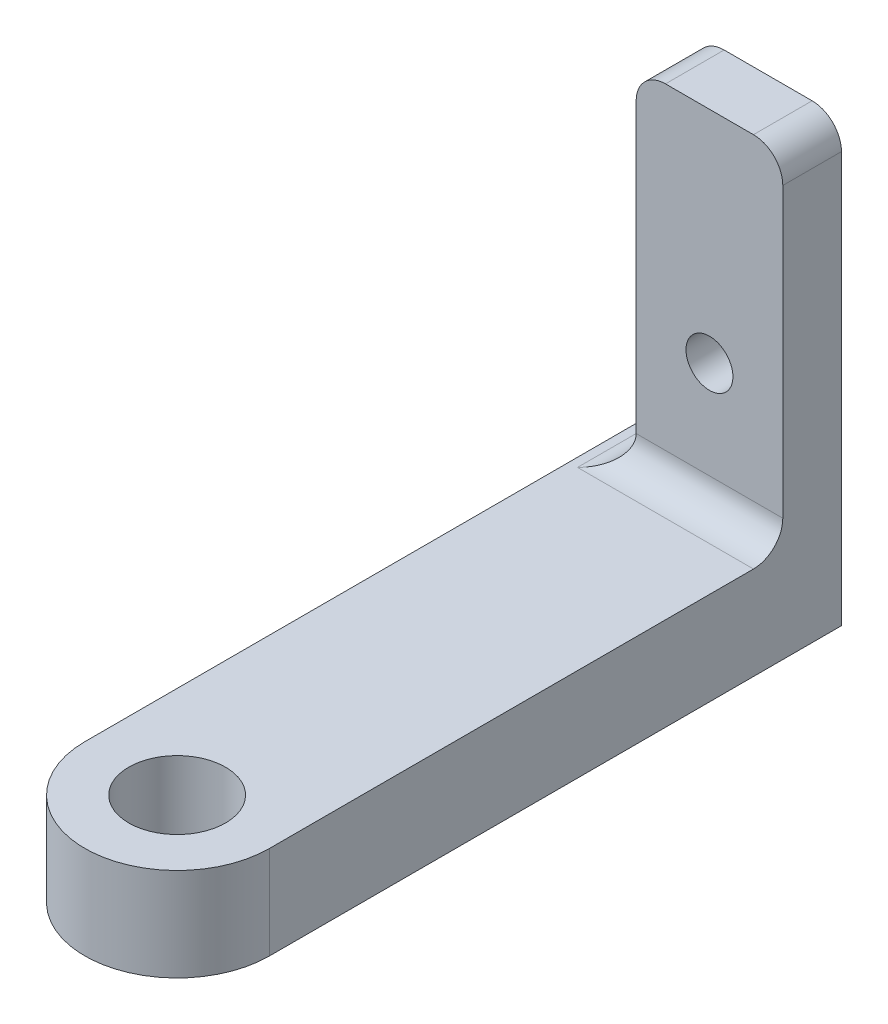
ISO-10303-21;
HEADER;
FILE_DESCRIPTION(('STEP AP214'),'2;1');
FILE_NAME('part.step','',(''),(''),'','','');
FILE_SCHEMA(('AUTOMOTIVE_DESIGN { 1 0 10303 214 1 1 1 1 }'));
ENDSEC;
DATA;
#1=APPLICATION_CONTEXT('core data for automotive mechanical design processes');
#2=APPLICATION_PROTOCOL_DEFINITION('international standard','automotive_design',2000,#1);
#3=PRODUCT_CONTEXT('',#1,'mechanical');
#4=PRODUCT('Part','Part','',(#3));
#5=PRODUCT_RELATED_PRODUCT_CATEGORY('part','',(#4));
#6=PRODUCT_DEFINITION_FORMATION('','',#4);
#7=PRODUCT_DEFINITION_CONTEXT('part definition',#1,'design');
#8=PRODUCT_DEFINITION('design','',#6,#7);
#9=PRODUCT_DEFINITION_SHAPE('','',#8);
#10=(LENGTH_UNIT() NAMED_UNIT(*) SI_UNIT(.MILLI.,.METRE.));
#11=(NAMED_UNIT(*) PLANE_ANGLE_UNIT() SI_UNIT($,.RADIAN.));
#12=(NAMED_UNIT(*) SI_UNIT($,.STERADIAN.) SOLID_ANGLE_UNIT());
#13=UNCERTAINTY_MEASURE_WITH_UNIT(LENGTH_MEASURE(1.E-05),#10,'distance_accuracy_value','');
#14=(GEOMETRIC_REPRESENTATION_CONTEXT(3) GLOBAL_UNCERTAINTY_ASSIGNED_CONTEXT((#13)) GLOBAL_UNIT_ASSIGNED_CONTEXT((#10,
#11,#12)) REPRESENTATION_CONTEXT('',''));
#15=CARTESIAN_POINT('',(0.,0.,0.));
#16=DIRECTION('',(0.,0.,1.));
#17=DIRECTION('',(1.,0.,0.));
#18=AXIS2_PLACEMENT_3D('',#15,#16,#17);
#19=CARTESIAN_POINT('',(0.,6.35,0.));
#20=DIRECTION('',(0.,-1.,0.));
#21=DIRECTION('',(0.,0.,-1.));
#22=AXIS2_PLACEMENT_3D('',#19,#20,#21);
#23=CYLINDRICAL_SURFACE('',#22,6.3);
#24=CARTESIAN_POINT('',(0.,0.,0.));
#25=DIRECTION('',(0.,1.,0.));
#26=DIRECTION('',(0.,0.,1.));
#27=AXIS2_PLACEMENT_3D('',#24,#25,#26);
#28=CIRCLE('',#27,6.3);
#29=CARTESIAN_POINT('',(-6.3,0.,0.));
#30=VERTEX_POINT('',#29);
#31=CARTESIAN_POINT('',(6.3,0.,0.));
#32=VERTEX_POINT('',#31);
#33=EDGE_CURVE('E153',#30,#32,#28,.T.);
#34=ORIENTED_EDGE('',*,*,#33,.T.);
#35=DIRECTION('',(0.,-1.,0.));
#36=VECTOR('',#35,1.);
#37=CARTESIAN_POINT('',(6.3,6.35,0.));
#38=LINE('',#37,#36);
#39=CARTESIAN_POINT('',(6.3,6.35,0.));
#40=VERTEX_POINT('',#39);
#41=EDGE_CURVE('E131',#40,#32,#38,.T.);
#42=ORIENTED_EDGE('',*,*,#41,.F.);
#43=CARTESIAN_POINT('',(0.,6.35,0.));
#44=DIRECTION('',(0.,1.,0.));
#45=DIRECTION('',(0.,0.,1.));
#46=AXIS2_PLACEMENT_3D('',#43,#44,#45);
#47=CIRCLE('',#46,6.3);
#48=CARTESIAN_POINT('',(-6.3,6.35,0.));
#49=VERTEX_POINT('',#48);
#50=EDGE_CURVE('E139',#49,#40,#47,.T.);
#51=ORIENTED_EDGE('',*,*,#50,.F.);
#52=DIRECTION('',(0.,-1.,0.));
#53=VECTOR('',#52,1.);
#54=CARTESIAN_POINT('',(-6.3,6.35,0.));
#55=LINE('',#54,#53);
#56=EDGE_CURVE('E253',#49,#30,#55,.T.);
#57=ORIENTED_EDGE('',*,*,#56,.T.);
#58=EDGE_LOOP('',(#34,#42,#51,#57));
#59=FACE_BOUND('',#58,.T.);
#60=ADVANCED_FACE('F45',(#59),#23,.T.);
#61=CARTESIAN_POINT('',(6.3,6.35,0.));
#62=DIRECTION('',(1.,0.,0.));
#63=DIRECTION('',(0.,0.,-1.));
#64=AXIS2_PLACEMENT_3D('',#61,#62,#63);
#65=PLANE('',#64);
#66=DIRECTION('',(0.,-1.,0.));
#67=VECTOR('',#66,1.);
#68=CARTESIAN_POINT('',(6.3,6.35,-39.));
#69=LINE('',#68,#67);
#70=CARTESIAN_POINT('',(6.3,28.,-39.));
#71=VERTEX_POINT('',#70);
#72=CARTESIAN_POINT('',(6.3,0.,-39.));
#73=VERTEX_POINT('',#72);
#74=EDGE_CURVE('E156',#71,#73,#69,.T.);
#75=ORIENTED_EDGE('',*,*,#74,.F.);
#76=DIRECTION('',(0.,0.,-1.));
#77=VECTOR('',#76,1.);
#78=CARTESIAN_POINT('',(6.3,28.,0.));
#79=LINE('',#78,#77);
#80=CARTESIAN_POINT('',(6.29999999999999,28.,-35.));
#81=VERTEX_POINT('',#80);
#82=EDGE_CURVE('E196',#71,#81,#79,.F.);
#83=ORIENTED_EDGE('',*,*,#82,.T.);
#84=DIRECTION('',(0.,-1.,0.));
#85=VECTOR('',#84,1.);
#86=CARTESIAN_POINT('',(6.29999999999999,0.,-35.));
#87=LINE('',#86,#85);
#88=CARTESIAN_POINT('',(6.29999999999999,8.35,-35.));
#89=VERTEX_POINT('',#88);
#90=EDGE_CURVE('E229',#81,#89,#87,.T.);
#91=ORIENTED_EDGE('',*,*,#90,.T.);
#92=CARTESIAN_POINT('',(6.3,8.35,-33.));
#93=DIRECTION('',(1.,0.,0.));
#94=DIRECTION('',(0.,0.,-1.));
#95=AXIS2_PLACEMENT_3D('',#92,#93,#94);
#96=CIRCLE('',#95,2.);
#97=CARTESIAN_POINT('',(6.3,6.35,-33.));
#98=VERTEX_POINT('',#97);
#99=EDGE_CURVE('E11',#89,#98,#96,.F.);
#100=ORIENTED_EDGE('',*,*,#99,.T.);
#101=DIRECTION('',(0.,0.,1.));
#102=VECTOR('',#101,1.);
#103=CARTESIAN_POINT('',(6.3,6.35,0.));
#104=LINE('',#103,#102);
#105=EDGE_CURVE('E126',#98,#40,#104,.T.);
#106=ORIENTED_EDGE('',*,*,#105,.T.);
#107=ORIENTED_EDGE('',*,*,#41,.T.);
#108=DIRECTION('',(0.,0.,1.));
#109=VECTOR('',#108,1.);
#110=CARTESIAN_POINT('',(6.3,0.,0.));
#111=LINE('',#110,#109);
#112=EDGE_CURVE('E257',#73,#32,#111,.T.);
#113=ORIENTED_EDGE('',*,*,#112,.F.);
#114=EDGE_LOOP('',(#75,#83,#91,#100,#106,#107,#113));
#115=FACE_BOUND('',#114,.T.);
#116=ADVANCED_FACE('F128',(#115),#65,.T.);
#117=CARTESIAN_POINT('',(0.,6.35,-39.));
#118=DIRECTION('',(0.,0.,-1.));
#119=DIRECTION('',(-1.,0.,0.));
#120=AXIS2_PLACEMENT_3D('',#117,#118,#119);
#121=PLANE('',#120);
#122=DIRECTION('',(1.,0.,0.));
#123=VECTOR('',#122,1.);
#124=CARTESIAN_POINT('',(6.29999999999999,30.,-39.));
#125=LINE('',#124,#123);
#126=CARTESIAN_POINT('',(-1.70000000000001,30.,-39.));
#127=VERTEX_POINT('',#126);
#128=CARTESIAN_POINT('',(4.3,30.,-39.));
#129=VERTEX_POINT('',#128);
#130=EDGE_CURVE('E216',#127,#129,#125,.T.);
#131=ORIENTED_EDGE('',*,*,#130,.T.);
#132=CARTESIAN_POINT('',(4.3,28.,-39.));
#133=DIRECTION('',(0.,0.,-1.));
#134=DIRECTION('',(-1.,0.,0.));
#135=AXIS2_PLACEMENT_3D('',#132,#133,#134);
#136=CIRCLE('',#135,2.);
#137=EDGE_CURVE('E62',#129,#71,#136,.T.);
#138=ORIENTED_EDGE('',*,*,#137,.T.);
#139=ORIENTED_EDGE('',*,*,#74,.T.);
#140=DIRECTION('',(1.,0.,0.));
#141=VECTOR('',#140,1.);
#142=CARTESIAN_POINT('',(0.,0.,-39.));
#143=LINE('',#142,#141);
#144=CARTESIAN_POINT('',(-6.3,0.,-39.));
#145=VERTEX_POINT('',#144);
#146=EDGE_CURVE('E260',#145,#73,#143,.T.);
#147=ORIENTED_EDGE('',*,*,#146,.F.);
#148=DIRECTION('',(0.,-1.,0.));
#149=VECTOR('',#148,1.);
#150=CARTESIAN_POINT('',(-6.3,6.35,-39.));
#151=LINE('',#150,#149);
#152=CARTESIAN_POINT('',(-6.3,6.35,-39.));
#153=VERTEX_POINT('',#152);
#154=EDGE_CURVE('E163',#153,#145,#151,.T.);
#155=ORIENTED_EDGE('',*,*,#154,.F.);
#156=DIRECTION('',(1.,0.,0.));
#157=VECTOR('',#156,1.);
#158=CARTESIAN_POINT('',(0.,6.35,-39.));
#159=LINE('',#158,#157);
#160=CARTESIAN_POINT('',(-5.70000000000001,6.35,-39.));
#161=VERTEX_POINT('',#160);
#162=EDGE_CURVE('E138',#153,#161,#159,.T.);
#163=ORIENTED_EDGE('',*,*,#162,.T.);
#164=CARTESIAN_POINT('',(-5.70000000000001,8.35,-39.));
#165=DIRECTION('',(0.,0.,-1.));
#166=DIRECTION('',(-1.,0.,0.));
#167=AXIS2_PLACEMENT_3D('',#164,#165,#166);
#168=CIRCLE('',#167,2.);
#169=CARTESIAN_POINT('',(-3.70000000000001,8.35,-39.));
#170=VERTEX_POINT('',#169);
#171=EDGE_CURVE('E55',#161,#170,#168,.F.);
#172=ORIENTED_EDGE('',*,*,#171,.T.);
#173=DIRECTION('',(0.,1.,0.));
#174=VECTOR('',#173,1.);
#175=CARTESIAN_POINT('',(-3.70000000000001,30.,-39.));
#176=LINE('',#175,#174);
#177=CARTESIAN_POINT('',(-3.70000000000001,28.,-39.));
#178=VERTEX_POINT('',#177);
#179=EDGE_CURVE('E206',#170,#178,#176,.T.);
#180=ORIENTED_EDGE('',*,*,#179,.T.);
#181=CARTESIAN_POINT('',(-1.70000000000001,28.,-39.));
#182=DIRECTION('',(0.,0.,-1.));
#183=DIRECTION('',(-1.,0.,0.));
#184=AXIS2_PLACEMENT_3D('',#181,#182,#183);
#185=CIRCLE('',#184,2.);
#186=EDGE_CURVE('E191',#178,#127,#185,.T.);
#187=ORIENTED_EDGE('',*,*,#186,.T.);
#188=EDGE_LOOP('',(#131,#138,#139,#147,#155,#163,#172,#180,#187));
#189=FACE_BOUND('',#188,.T.);
#190=CARTESIAN_POINT('',(1.29999999999999,15.,-39.));
#191=DIRECTION('',(0.,0.,-1.));
#192=DIRECTION('',(-1.,0.,0.));
#193=AXIS2_PLACEMENT_3D('',#190,#191,#192);
#194=CIRCLE('',#193,1.6);
#195=CARTESIAN_POINT('',(-0.300000000000007,15.,-39.));
#196=VERTEX_POINT('',#195);
#197=EDGE_CURVE('E224',#196,#196,#194,.T.);
#198=ORIENTED_EDGE('',*,*,#197,.F.);
#199=EDGE_LOOP('',(#198));
#200=FACE_BOUND('',#199,.T.);
#201=ADVANCED_FACE('F204',(#189,#200),#121,.T.);
#202=CARTESIAN_POINT('',(0.,6.35,0.));
#203=DIRECTION('',(0.,-1.,0.));
#204=DIRECTION('',(0.,0.,-1.));
#205=AXIS2_PLACEMENT_3D('',#202,#203,#204);
#206=CYLINDRICAL_SURFACE('',#205,3.3);
#207=CARTESIAN_POINT('',(0.,6.35,0.));
#208=DIRECTION('',(0.,1.,0.));
#209=DIRECTION('',(0.,0.,1.));
#210=AXIS2_PLACEMENT_3D('',#207,#208,#209);
#211=CIRCLE('',#210,3.3);
#212=CARTESIAN_POINT('',(0.,6.35,3.3));
#213=VERTEX_POINT('',#212);
#214=EDGE_CURVE('E150',#213,#213,#211,.T.);
#215=ORIENTED_EDGE('',*,*,#214,.T.);
#216=EDGE_LOOP('',(#215));
#217=FACE_BOUND('',#216,.T.);
#218=CARTESIAN_POINT('',(0.,0.,0.));
#219=DIRECTION('',(0.,1.,0.));
#220=DIRECTION('',(0.,0.,1.));
#221=AXIS2_PLACEMENT_3D('',#218,#219,#220);
#222=CIRCLE('',#221,3.3);
#223=CARTESIAN_POINT('',(0.,0.,3.3));
#224=VERTEX_POINT('',#223);
#225=EDGE_CURVE('E233',#224,#224,#222,.T.);
#226=ORIENTED_EDGE('',*,*,#225,.F.);
#227=EDGE_LOOP('',(#226));
#228=FACE_BOUND('',#227,.T.);
#229=ADVANCED_FACE('F299',(#217,#228),#206,.F.);
#230=CARTESIAN_POINT('',(-6.3,6.35,0.));
#231=DIRECTION('',(-1.,0.,0.));
#232=DIRECTION('',(0.,0.,1.));
#233=AXIS2_PLACEMENT_3D('',#230,#231,#232);
#234=PLANE('',#233);
#235=DIRECTION('',(0.,0.,-1.));
#236=VECTOR('',#235,1.);
#237=CARTESIAN_POINT('',(-6.3,0.,0.));
#238=LINE('',#237,#236);
#239=EDGE_CURVE('E248',#30,#145,#238,.T.);
#240=ORIENTED_EDGE('',*,*,#239,.F.);
#241=ORIENTED_EDGE('',*,*,#56,.F.);
#242=DIRECTION('',(0.,0.,-1.));
#243=VECTOR('',#242,1.);
#244=CARTESIAN_POINT('',(-6.3,6.35,0.));
#245=LINE('',#244,#243);
#246=EDGE_CURVE('E147',#49,#153,#245,.T.);
#247=ORIENTED_EDGE('',*,*,#246,.T.);
#248=ORIENTED_EDGE('',*,*,#154,.T.);
#249=EDGE_LOOP('',(#240,#241,#247,#248));
#250=FACE_BOUND('',#249,.T.);
#251=ADVANCED_FACE('F272',(#250),#234,.T.);
#252=CARTESIAN_POINT('',(0.,6.35,0.));
#253=DIRECTION('',(0.,1.,0.));
#254=DIRECTION('',(0.,0.,1.));
#255=AXIS2_PLACEMENT_3D('',#252,#253,#254);
#256=PLANE('',#255);
#257=DIRECTION('',(1.,0.,0.));
#258=VECTOR('',#257,1.);
#259=CARTESIAN_POINT('',(-3.70000000000001,6.35,-33.));
#260=LINE('',#259,#258);
#261=CARTESIAN_POINT('',(-5.70000000000001,6.35,-33.));
#262=VERTEX_POINT('',#261);
#263=EDGE_CURVE('E170',#98,#262,#260,.F.);
#264=ORIENTED_EDGE('',*,*,#263,.T.);
#265=DIRECTION('',(0.,0.,1.));
#266=VECTOR('',#265,1.);
#267=CARTESIAN_POINT('',(-5.70000000000001,6.35,-39.));
#268=LINE('',#267,#266);
#269=EDGE_CURVE('E173',#262,#161,#268,.F.);
#270=ORIENTED_EDGE('',*,*,#269,.T.);
#271=ORIENTED_EDGE('',*,*,#162,.F.);
#272=ORIENTED_EDGE('',*,*,#246,.F.);
#273=ORIENTED_EDGE('',*,*,#50,.T.);
#274=ORIENTED_EDGE('',*,*,#105,.F.);
#275=EDGE_LOOP('',(#264,#270,#271,#272,#273,#274));
#276=FACE_BOUND('',#275,.T.);
#277=ORIENTED_EDGE('',*,*,#214,.F.);
#278=EDGE_LOOP('',(#277));
#279=FACE_BOUND('',#278,.T.);
#280=ADVANCED_FACE('F143',(#276,#279),#256,.T.);
#281=CARTESIAN_POINT('',(0.,0.,0.));
#282=DIRECTION('',(0.,1.,0.));
#283=DIRECTION('',(0.,0.,1.));
#284=AXIS2_PLACEMENT_3D('',#281,#282,#283);
#285=PLANE('',#284);
#286=ORIENTED_EDGE('',*,*,#225,.T.);
#287=EDGE_LOOP('',(#286));
#288=FACE_BOUND('',#287,.T.);
#289=ORIENTED_EDGE('',*,*,#146,.T.);
#290=ORIENTED_EDGE('',*,*,#112,.T.);
#291=ORIENTED_EDGE('',*,*,#33,.F.);
#292=ORIENTED_EDGE('',*,*,#239,.T.);
#293=EDGE_LOOP('',(#289,#290,#291,#292));
#294=FACE_BOUND('',#293,.T.);
#295=ADVANCED_FACE('F274',(#288,#294),#285,.F.);
#296=CARTESIAN_POINT('',(6.29999999999999,30.,-35.));
#297=DIRECTION('',(0.,1.,0.));
#298=DIRECTION('',(0.,0.,1.));
#299=AXIS2_PLACEMENT_3D('',#296,#297,#298);
#300=PLANE('',#299);
#301=DIRECTION('',(1.,0.,0.));
#302=VECTOR('',#301,1.);
#303=CARTESIAN_POINT('',(6.29999999999999,30.,-35.));
#304=LINE('',#303,#302);
#305=CARTESIAN_POINT('',(-1.70000000000001,30.,-35.));
#306=VERTEX_POINT('',#305);
#307=CARTESIAN_POINT('',(4.3,30.,-35.));
#308=VERTEX_POINT('',#307);
#309=EDGE_CURVE('E234',#306,#308,#304,.T.);
#310=ORIENTED_EDGE('',*,*,#309,.T.);
#311=DIRECTION('',(0.,0.,-1.));
#312=VECTOR('',#311,1.);
#313=CARTESIAN_POINT('',(4.3,30.,-35.));
#314=LINE('',#313,#312);
#315=EDGE_CURVE('E188',#308,#129,#314,.T.);
#316=ORIENTED_EDGE('',*,*,#315,.T.);
#317=ORIENTED_EDGE('',*,*,#130,.F.);
#318=DIRECTION('',(0.,0.,-1.));
#319=VECTOR('',#318,1.);
#320=CARTESIAN_POINT('',(-1.70000000000001,30.,-35.));
#321=LINE('',#320,#319);
#322=EDGE_CURVE('E185',#127,#306,#321,.F.);
#323=ORIENTED_EDGE('',*,*,#322,.T.);
#324=EDGE_LOOP('',(#310,#316,#317,#323));
#325=FACE_BOUND('',#324,.T.);
#326=ADVANCED_FACE('F279',(#325),#300,.T.);
#327=CARTESIAN_POINT('',(-3.70000000000001,30.,-35.));
#328=DIRECTION('',(-1.,0.,0.));
#329=DIRECTION('',(0.,-1.,0.));
#330=AXIS2_PLACEMENT_3D('',#327,#328,#329);
#331=PLANE('',#330);
#332=ORIENTED_EDGE('',*,*,#179,.F.);
#333=DIRECTION('',(0.,0.,1.));
#334=VECTOR('',#333,1.);
#335=CARTESIAN_POINT('',(-3.70000000000001,8.35,-35.));
#336=LINE('',#335,#334);
#337=CARTESIAN_POINT('',(-3.70000000000001,8.35,-35.));
#338=VERTEX_POINT('',#337);
#339=EDGE_CURVE('E161',#170,#338,#336,.T.);
#340=ORIENTED_EDGE('',*,*,#339,.T.);
#341=DIRECTION('',(0.,1.,0.));
#342=VECTOR('',#341,1.);
#343=CARTESIAN_POINT('',(-3.70000000000001,30.,-35.));
#344=LINE('',#343,#342);
#345=CARTESIAN_POINT('',(-3.70000000000001,28.,-35.));
#346=VERTEX_POINT('',#345);
#347=EDGE_CURVE('E231',#338,#346,#344,.T.);
#348=ORIENTED_EDGE('',*,*,#347,.T.);
#349=DIRECTION('',(0.,0.,-1.));
#350=VECTOR('',#349,1.);
#351=CARTESIAN_POINT('',(-3.70000000000001,28.,-35.));
#352=LINE('',#351,#350);
#353=EDGE_CURVE('E155',#346,#178,#352,.T.);
#354=ORIENTED_EDGE('',*,*,#353,.T.);
#355=EDGE_LOOP('',(#332,#340,#348,#354));
#356=FACE_BOUND('',#355,.T.);
#357=ADVANCED_FACE('F211',(#356),#331,.T.);
#358=CARTESIAN_POINT('',(0.,0.,-35.));
#359=DIRECTION('',(0.,0.,1.));
#360=DIRECTION('',(1.,0.,0.));
#361=AXIS2_PLACEMENT_3D('',#358,#359,#360);
#362=PLANE('',#361);
#363=CARTESIAN_POINT('',(1.29999999999999,15.,-35.));
#364=DIRECTION('',(0.,0.,-1.));
#365=DIRECTION('',(-1.,0.,0.));
#366=AXIS2_PLACEMENT_3D('',#363,#364,#365);
#367=CIRCLE('',#366,1.6);
#368=CARTESIAN_POINT('',(-0.300000000000007,15.,-35.));
#369=VERTEX_POINT('',#368);
#370=EDGE_CURVE('E217',#369,#369,#367,.T.);
#371=ORIENTED_EDGE('',*,*,#370,.T.);
#372=EDGE_LOOP('',(#371));
#373=FACE_BOUND('',#372,.T.);
#374=ORIENTED_EDGE('',*,*,#347,.F.);
#375=DIRECTION('',(1.,0.,0.));
#376=VECTOR('',#375,1.);
#377=CARTESIAN_POINT('',(6.29999999999999,8.35,-35.));
#378=LINE('',#377,#376);
#379=EDGE_CURVE('E182',#338,#89,#378,.T.);
#380=ORIENTED_EDGE('',*,*,#379,.T.);
#381=ORIENTED_EDGE('',*,*,#90,.F.);
#382=CARTESIAN_POINT('',(4.3,28.,-35.));
#383=DIRECTION('',(0.,0.,1.));
#384=DIRECTION('',(1.,0.,0.));
#385=AXIS2_PLACEMENT_3D('',#382,#383,#384);
#386=CIRCLE('',#385,2.);
#387=EDGE_CURVE('E179',#81,#308,#386,.T.);
#388=ORIENTED_EDGE('',*,*,#387,.T.);
#389=ORIENTED_EDGE('',*,*,#309,.F.);
#390=CARTESIAN_POINT('',(-1.70000000000001,28.,-35.));
#391=DIRECTION('',(0.,0.,1.));
#392=DIRECTION('',(1.,0.,0.));
#393=AXIS2_PLACEMENT_3D('',#390,#391,#392);
#394=CIRCLE('',#393,2.);
#395=EDGE_CURVE('E176',#306,#346,#394,.T.);
#396=ORIENTED_EDGE('',*,*,#395,.T.);
#397=EDGE_LOOP('',(#374,#380,#381,#388,#389,#396));
#398=FACE_BOUND('',#397,.T.);
#399=ADVANCED_FACE('F228',(#373,#398),#362,.T.);
#400=CARTESIAN_POINT('',(1.29999999999999,15.,-35.));
#401=DIRECTION('',(0.,0.,-1.));
#402=DIRECTION('',(-1.,0.,0.));
#403=AXIS2_PLACEMENT_3D('',#400,#401,#402);
#404=CYLINDRICAL_SURFACE('',#403,1.6);
#405=ORIENTED_EDGE('',*,*,#370,.F.);
#406=EDGE_LOOP('',(#405));
#407=FACE_BOUND('',#406,.T.);
#408=ORIENTED_EDGE('',*,*,#197,.T.);
#409=EDGE_LOOP('',(#408));
#410=FACE_BOUND('',#409,.T.);
#411=ADVANCED_FACE('F293',(#407,#410),#404,.F.);
#412=CARTESIAN_POINT('',(0.,8.35,-33.));
#413=DIRECTION('',(-1.,0.,0.));
#414=DIRECTION('',(0.,0.,1.));
#415=AXIS2_PLACEMENT_3D('',#412,#413,#414);
#416=CYLINDRICAL_SURFACE('',#415,2.);
#417=ORIENTED_EDGE('',*,*,#99,.F.);
#418=ORIENTED_EDGE('',*,*,#379,.F.);
#419=CARTESIAN_POINT('',(-5.70000000000001,8.35,-33.));
#420=DIRECTION('',(-0.707106781186547,0.,-0.707106781186547));
#421=DIRECTION('',(-0.707106781186547,0.,0.707106781186547));
#422=AXIS2_PLACEMENT_3D('',#419,#420,#421);
#423=ELLIPSE('',#422,2.82842712474619,2.);
#424=EDGE_CURVE('E49',#262,#338,#423,.F.);
#425=ORIENTED_EDGE('',*,*,#424,.F.);
#426=ORIENTED_EDGE('',*,*,#263,.F.);
#427=EDGE_LOOP('',(#417,#418,#425,#426));
#428=FACE_BOUND('',#427,.T.);
#429=ADVANCED_FACE('F225',(#428),#416,.F.);
#430=CARTESIAN_POINT('',(-5.70000000000001,8.35,-35.));
#431=DIRECTION('',(0.,0.,-1.));
#432=DIRECTION('',(-1.,0.,0.));
#433=AXIS2_PLACEMENT_3D('',#430,#431,#432);
#434=CYLINDRICAL_SURFACE('',#433,2.);
#435=ORIENTED_EDGE('',*,*,#171,.F.);
#436=ORIENTED_EDGE('',*,*,#269,.F.);
#437=ORIENTED_EDGE('',*,*,#424,.T.);
#438=ORIENTED_EDGE('',*,*,#339,.F.);
#439=EDGE_LOOP('',(#435,#436,#437,#438));
#440=FACE_BOUND('',#439,.T.);
#441=ADVANCED_FACE('F219',(#440),#434,.F.);
#442=CARTESIAN_POINT('',(4.3,28.,-35.));
#443=DIRECTION('',(0.,0.,-1.));
#444=DIRECTION('',(-1.,0.,0.));
#445=AXIS2_PLACEMENT_3D('',#442,#443,#444);
#446=CYLINDRICAL_SURFACE('',#445,2.);
#447=ORIENTED_EDGE('',*,*,#387,.F.);
#448=ORIENTED_EDGE('',*,*,#82,.F.);
#449=ORIENTED_EDGE('',*,*,#137,.F.);
#450=ORIENTED_EDGE('',*,*,#315,.F.);
#451=EDGE_LOOP('',(#447,#448,#449,#450));
#452=FACE_BOUND('',#451,.T.);
#453=ADVANCED_FACE('F275',(#452),#446,.T.);
#454=CARTESIAN_POINT('',(-1.70000000000001,28.,-35.));
#455=DIRECTION('',(0.,0.,-1.));
#456=DIRECTION('',(-1.,0.,0.));
#457=AXIS2_PLACEMENT_3D('',#454,#455,#456);
#458=CYLINDRICAL_SURFACE('',#457,2.);
#459=ORIENTED_EDGE('',*,*,#395,.F.);
#460=ORIENTED_EDGE('',*,*,#322,.F.);
#461=ORIENTED_EDGE('',*,*,#186,.F.);
#462=ORIENTED_EDGE('',*,*,#353,.F.);
#463=EDGE_LOOP('',(#459,#460,#461,#462));
#464=FACE_BOUND('',#463,.T.);
#465=ADVANCED_FACE('F47',(#464),#458,.T.);
#466=CLOSED_SHELL('',(#60,#116,#201,#229,#251,#280,#295,#326,#357,#399,#411,#429,#441,#453,#465));
#467=MANIFOLD_SOLID_BREP('B2',#466);
#468=ADVANCED_BREP_SHAPE_REPRESENTATION('',(#18,#467),#14);
#469=SHAPE_DEFINITION_REPRESENTATION(#9,#468);
ENDSEC;
END-ISO-10303-21;
